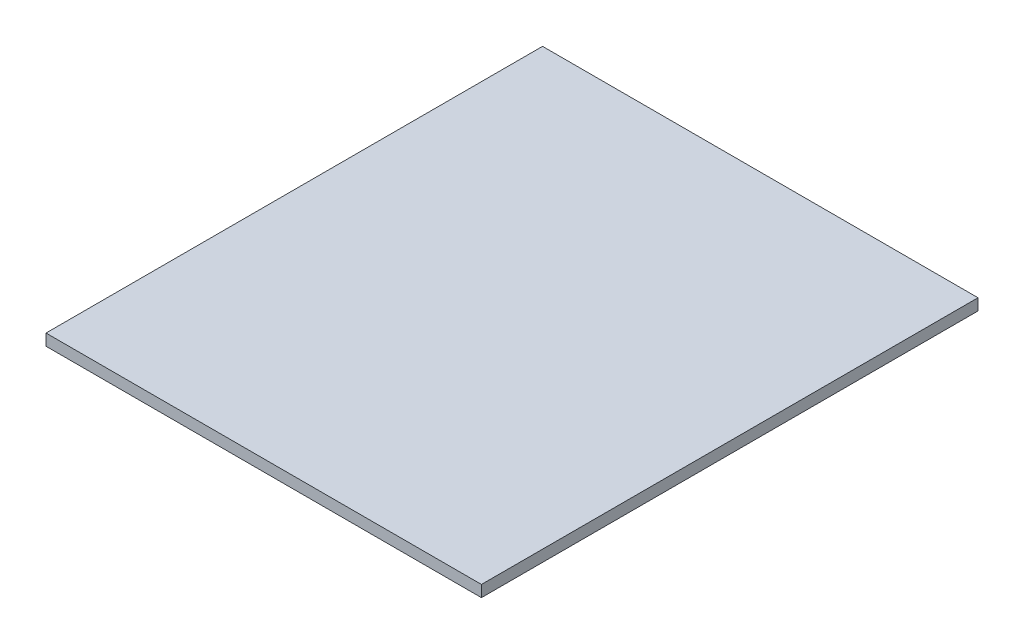
ISO-10303-21;
HEADER;
FILE_DESCRIPTION(('STEP AP214'),'2;1');
FILE_NAME('part.step','',(''),(''),'','','');
FILE_SCHEMA(('AUTOMOTIVE_DESIGN { 1 0 10303 214 1 1 1 1 }'));
ENDSEC;
DATA;
#1=APPLICATION_CONTEXT('core data for automotive mechanical design processes');
#2=APPLICATION_PROTOCOL_DEFINITION('international standard','automotive_design',2000,#1);
#3=PRODUCT_CONTEXT('',#1,'mechanical');
#4=PRODUCT('Part','Part','',(#3));
#5=PRODUCT_RELATED_PRODUCT_CATEGORY('part','',(#4));
#6=PRODUCT_DEFINITION_FORMATION('','',#4);
#7=PRODUCT_DEFINITION_CONTEXT('part definition',#1,'design');
#8=PRODUCT_DEFINITION('design','',#6,#7);
#9=PRODUCT_DEFINITION_SHAPE('','',#8);
#10=(LENGTH_UNIT() NAMED_UNIT(*) SI_UNIT(.MILLI.,.METRE.));
#11=(NAMED_UNIT(*) PLANE_ANGLE_UNIT() SI_UNIT($,.RADIAN.));
#12=(NAMED_UNIT(*) SI_UNIT($,.STERADIAN.) SOLID_ANGLE_UNIT());
#13=UNCERTAINTY_MEASURE_WITH_UNIT(LENGTH_MEASURE(1.E-05),#10,'distance_accuracy_value','');
#14=(GEOMETRIC_REPRESENTATION_CONTEXT(3) GLOBAL_UNCERTAINTY_ASSIGNED_CONTEXT((#13)) GLOBAL_UNIT_ASSIGNED_CONTEXT((#10,
#11,#12)) REPRESENTATION_CONTEXT('',''));
#15=CARTESIAN_POINT('',(0.,0.,0.));
#16=DIRECTION('',(0.,0.,1.));
#17=DIRECTION('',(1.,0.,0.));
#18=AXIS2_PLACEMENT_3D('',#15,#16,#17);
#19=CARTESIAN_POINT('',(-180.,3.,-13.0000000000001));
#20=DIRECTION('',(-1.,0.,0.));
#21=DIRECTION('',(0.,0.,1.));
#22=AXIS2_PLACEMENT_3D('',#19,#20,#21);
#23=PLANE('',#22);
#24=DIRECTION('',(0.,0.,-1.));
#25=VECTOR('',#24,1.);
#26=CARTESIAN_POINT('',(-180.,0.,-13.0000000000001));
#27=LINE('',#26,#25);
#28=CARTESIAN_POINT('',(-180.,0.,117.));
#29=VERTEX_POINT('',#28);
#30=CARTESIAN_POINT('',(-180.,0.,-13.0000000000001));
#31=VERTEX_POINT('',#30);
#32=EDGE_CURVE('E96',#29,#31,#27,.T.);
#33=ORIENTED_EDGE('',*,*,#32,.T.);
#34=DIRECTION('',(0.,-1.,0.));
#35=VECTOR('',#34,1.);
#36=CARTESIAN_POINT('',(-180.,3.,-13.0000000000001));
#37=LINE('',#36,#35);
#38=CARTESIAN_POINT('',(-180.,3.,-13.0000000000001));
#39=VERTEX_POINT('',#38);
#40=EDGE_CURVE('E11',#39,#31,#37,.T.);
#41=ORIENTED_EDGE('',*,*,#40,.F.);
#42=DIRECTION('',(0.,0.,-1.));
#43=VECTOR('',#42,1.);
#44=CARTESIAN_POINT('',(-180.,3.,-13.0000000000001));
#45=LINE('',#44,#43);
#46=CARTESIAN_POINT('',(-180.,3.,117.));
#47=VERTEX_POINT('',#46);
#48=EDGE_CURVE('E84',#47,#39,#45,.T.);
#49=ORIENTED_EDGE('',*,*,#48,.F.);
#50=DIRECTION('',(0.,-1.,0.));
#51=VECTOR('',#50,1.);
#52=CARTESIAN_POINT('',(-180.,3.,117.));
#53=LINE('',#52,#51);
#54=EDGE_CURVE('E92',#47,#29,#53,.T.);
#55=ORIENTED_EDGE('',*,*,#54,.T.);
#56=EDGE_LOOP('',(#33,#41,#49,#55));
#57=FACE_BOUND('',#56,.T.);
#58=ADVANCED_FACE('F33',(#57),#23,.F.);
#59=CARTESIAN_POINT('',(-180.,3.,-13.0000000000001));
#60=DIRECTION('',(0.,0.,1.));
#61=DIRECTION('',(1.,0.,0.));
#62=AXIS2_PLACEMENT_3D('',#59,#60,#61);
#63=PLANE('',#62);
#64=DIRECTION('',(-1.,0.,0.));
#65=VECTOR('',#64,1.);
#66=CARTESIAN_POINT('',(-180.,0.,-13.0000000000001));
#67=LINE('',#66,#65);
#68=CARTESIAN_POINT('',(-294.,0.,-13.));
#69=VERTEX_POINT('',#68);
#70=EDGE_CURVE('E88',#31,#69,#67,.T.);
#71=ORIENTED_EDGE('',*,*,#70,.T.);
#72=DIRECTION('',(0.,-1.,0.));
#73=VECTOR('',#72,1.);
#74=CARTESIAN_POINT('',(-294.,3.,-13.));
#75=LINE('',#74,#73);
#76=CARTESIAN_POINT('',(-294.,3.,-13.));
#77=VERTEX_POINT('',#76);
#78=EDGE_CURVE('E41',#77,#69,#75,.T.);
#79=ORIENTED_EDGE('',*,*,#78,.F.);
#80=DIRECTION('',(-1.,0.,0.));
#81=VECTOR('',#80,1.);
#82=CARTESIAN_POINT('',(-180.,3.,-13.0000000000001));
#83=LINE('',#82,#81);
#84=EDGE_CURVE('E79',#39,#77,#83,.T.);
#85=ORIENTED_EDGE('',*,*,#84,.F.);
#86=ORIENTED_EDGE('',*,*,#40,.T.);
#87=EDGE_LOOP('',(#71,#79,#85,#86));
#88=FACE_BOUND('',#87,.T.);
#89=ADVANCED_FACE('F87',(#88),#63,.F.);
#90=CARTESIAN_POINT('',(-294.,3.,-13.));
#91=DIRECTION('',(1.,0.,0.));
#92=DIRECTION('',(0.,0.,-1.));
#93=AXIS2_PLACEMENT_3D('',#90,#91,#92);
#94=PLANE('',#93);
#95=DIRECTION('',(0.,0.,1.));
#96=VECTOR('',#95,1.);
#97=CARTESIAN_POINT('',(-294.,0.,-13.));
#98=LINE('',#97,#96);
#99=CARTESIAN_POINT('',(-294.,0.,117.));
#100=VERTEX_POINT('',#99);
#101=EDGE_CURVE('E66',#69,#100,#98,.T.);
#102=ORIENTED_EDGE('',*,*,#101,.T.);
#103=DIRECTION('',(0.,-1.,0.));
#104=VECTOR('',#103,1.);
#105=CARTESIAN_POINT('',(-294.,3.,117.));
#106=LINE('',#105,#104);
#107=CARTESIAN_POINT('',(-294.,3.,117.));
#108=VERTEX_POINT('',#107);
#109=EDGE_CURVE('E89',#108,#100,#106,.T.);
#110=ORIENTED_EDGE('',*,*,#109,.F.);
#111=DIRECTION('',(0.,0.,1.));
#112=VECTOR('',#111,1.);
#113=CARTESIAN_POINT('',(-294.,3.,-13.));
#114=LINE('',#113,#112);
#115=EDGE_CURVE('E82',#77,#108,#114,.T.);
#116=ORIENTED_EDGE('',*,*,#115,.F.);
#117=ORIENTED_EDGE('',*,*,#78,.T.);
#118=EDGE_LOOP('',(#102,#110,#116,#117));
#119=FACE_BOUND('',#118,.T.);
#120=ADVANCED_FACE('F90',(#119),#94,.F.);
#121=CARTESIAN_POINT('',(-180.,3.,117.));
#122=DIRECTION('',(0.,0.,-1.));
#123=DIRECTION('',(-1.,0.,0.));
#124=AXIS2_PLACEMENT_3D('',#121,#122,#123);
#125=PLANE('',#124);
#126=DIRECTION('',(1.,0.,0.));
#127=VECTOR('',#126,1.);
#128=CARTESIAN_POINT('',(-180.,0.,117.));
#129=LINE('',#128,#127);
#130=EDGE_CURVE('E72',#100,#29,#129,.T.);
#131=ORIENTED_EDGE('',*,*,#130,.T.);
#132=ORIENTED_EDGE('',*,*,#54,.F.);
#133=DIRECTION('',(1.,0.,0.));
#134=VECTOR('',#133,1.);
#135=CARTESIAN_POINT('',(-180.,3.,117.));
#136=LINE('',#135,#134);
#137=EDGE_CURVE('E49',#108,#47,#136,.T.);
#138=ORIENTED_EDGE('',*,*,#137,.F.);
#139=ORIENTED_EDGE('',*,*,#109,.T.);
#140=EDGE_LOOP('',(#131,#132,#138,#139));
#141=FACE_BOUND('',#140,.T.);
#142=ADVANCED_FACE('F103',(#141),#125,.F.);
#143=CARTESIAN_POINT('',(0.,3.,0.));
#144=DIRECTION('',(0.,-1.,0.));
#145=DIRECTION('',(0.,0.,-1.));
#146=AXIS2_PLACEMENT_3D('',#143,#144,#145);
#147=PLANE('',#146);
#148=ORIENTED_EDGE('',*,*,#48,.T.);
#149=ORIENTED_EDGE('',*,*,#84,.T.);
#150=ORIENTED_EDGE('',*,*,#115,.T.);
#151=ORIENTED_EDGE('',*,*,#137,.T.);
#152=EDGE_LOOP('',(#148,#149,#150,#151));
#153=FACE_BOUND('',#152,.T.);
#154=ADVANCED_FACE('F80',(#153),#147,.F.);
#155=CARTESIAN_POINT('',(0.,0.,0.));
#156=DIRECTION('',(0.,-1.,0.));
#157=DIRECTION('',(0.,0.,-1.));
#158=AXIS2_PLACEMENT_3D('',#155,#156,#157);
#159=PLANE('',#158);
#160=ORIENTED_EDGE('',*,*,#32,.F.);
#161=ORIENTED_EDGE('',*,*,#130,.F.);
#162=ORIENTED_EDGE('',*,*,#101,.F.);
#163=ORIENTED_EDGE('',*,*,#70,.F.);
#164=EDGE_LOOP('',(#160,#161,#162,#163));
#165=FACE_BOUND('',#164,.T.);
#166=ADVANCED_FACE('F106',(#165),#159,.T.);
#167=CLOSED_SHELL('',(#58,#89,#120,#142,#154,#166));
#168=MANIFOLD_SOLID_BREP('B2',#167);
#169=ADVANCED_BREP_SHAPE_REPRESENTATION('',(#18,#168),#14);
#170=SHAPE_DEFINITION_REPRESENTATION(#9,#169);
ENDSEC;
END-ISO-10303-21;
